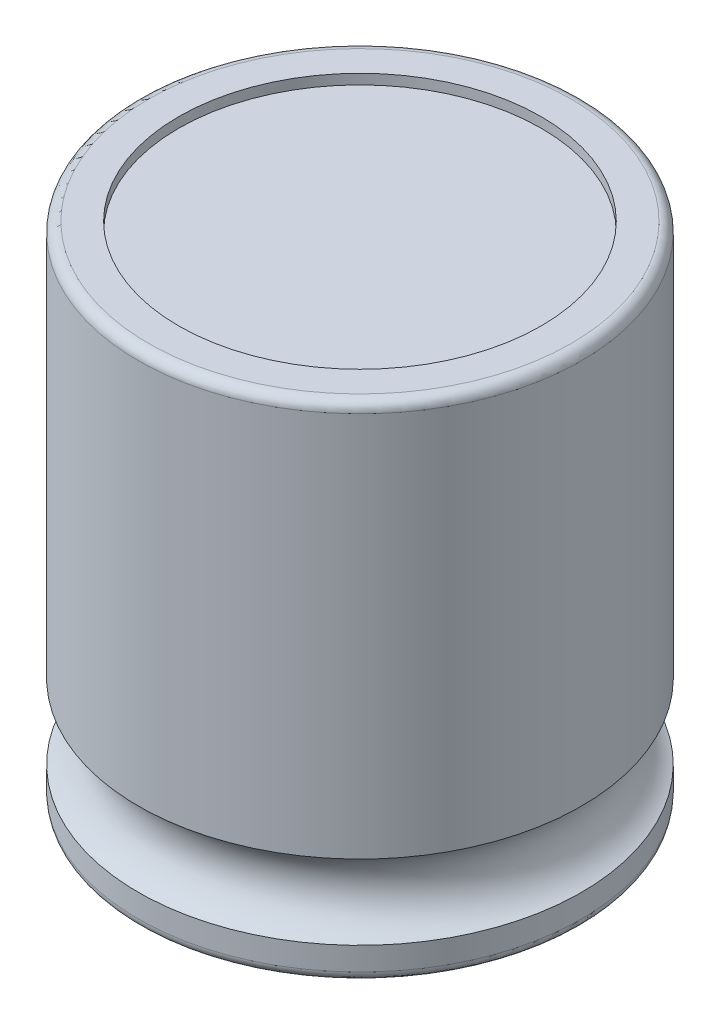
ISO-10303-21;
HEADER;
FILE_DESCRIPTION(('STEP AP214'),'2;1');
FILE_NAME('part.step','',(''),(''),'','','');
FILE_SCHEMA(('AUTOMOTIVE_DESIGN { 1 0 10303 214 1 1 1 1 }'));
ENDSEC;
DATA;
#1=APPLICATION_CONTEXT('core data for automotive mechanical design processes');
#2=APPLICATION_PROTOCOL_DEFINITION('international standard','automotive_design',2000,#1);
#3=PRODUCT_CONTEXT('',#1,'mechanical');
#4=PRODUCT('Part','Part','',(#3));
#5=PRODUCT_RELATED_PRODUCT_CATEGORY('part','',(#4));
#6=PRODUCT_DEFINITION_FORMATION('','',#4);
#7=PRODUCT_DEFINITION_CONTEXT('part definition',#1,'design');
#8=PRODUCT_DEFINITION('design','',#6,#7);
#9=PRODUCT_DEFINITION_SHAPE('','',#8);
#10=(LENGTH_UNIT() NAMED_UNIT(*) SI_UNIT(.MILLI.,.METRE.));
#11=(NAMED_UNIT(*) PLANE_ANGLE_UNIT() SI_UNIT($,.RADIAN.));
#12=(NAMED_UNIT(*) SI_UNIT($,.STERADIAN.) SOLID_ANGLE_UNIT());
#13=UNCERTAINTY_MEASURE_WITH_UNIT(LENGTH_MEASURE(1.E-05),#10,'distance_accuracy_value','');
#14=(GEOMETRIC_REPRESENTATION_CONTEXT(3) GLOBAL_UNCERTAINTY_ASSIGNED_CONTEXT((#13)) GLOBAL_UNIT_ASSIGNED_CONTEXT((#10,
#11,#12)) REPRESENTATION_CONTEXT('',''));
#15=CARTESIAN_POINT('',(0.,0.,0.));
#16=DIRECTION('',(0.,0.,1.));
#17=DIRECTION('',(1.,0.,0.));
#18=AXIS2_PLACEMENT_3D('',#15,#16,#17);
#19=CARTESIAN_POINT('',(0.,1.,0.));
#20=DIRECTION('',(0.,-1.,0.));
#21=DIRECTION('',(0.,0.,-1.));
#22=AXIS2_PLACEMENT_3D('',#19,#20,#21);
#23=PLANE('',#22);
#24=CARTESIAN_POINT('',(0.,1.,0.));
#25=DIRECTION('',(0.,-1.,0.));
#26=DIRECTION('',(0.,0.,-1.));
#27=AXIS2_PLACEMENT_3D('',#24,#25,#26);
#28=CIRCLE('',#27,9.);
#29=CARTESIAN_POINT('',(0.,1.,-9.));
#30=VERTEX_POINT('',#29);
#31=EDGE_CURVE('E280',#30,#30,#28,.T.);
#32=ORIENTED_EDGE('',*,*,#31,.T.);
#33=EDGE_LOOP('',(#32));
#34=FACE_BOUND('',#33,.T.);
#35=ADVANCED_FACE('F17',(#34),#23,.T.);
#36=CARTESIAN_POINT('',(0.,-65.12685950413,0.));
#37=DIRECTION('',(0.,-1.,0.));
#38=DIRECTION('',(0.,0.,-1.));
#39=AXIS2_PLACEMENT_3D('',#36,#37,#38);
#40=CYLINDRICAL_SURFACE('',#39,9.);
#41=ORIENTED_EDGE('',*,*,#31,.F.);
#42=EDGE_LOOP('',(#41));
#43=FACE_BOUND('',#42,.T.);
#44=CARTESIAN_POINT('',(0.,0.,0.));
#45=DIRECTION('',(0.,-1.,0.));
#46=DIRECTION('',(0.,0.,-1.));
#47=AXIS2_PLACEMENT_3D('',#44,#45,#46);
#48=CIRCLE('',#47,9.);
#49=CARTESIAN_POINT('',(0.,0.,-9.));
#50=VERTEX_POINT('',#49);
#51=EDGE_CURVE('E83',#50,#50,#48,.F.);
#52=ORIENTED_EDGE('',*,*,#51,.F.);
#53=EDGE_LOOP('',(#52));
#54=FACE_BOUND('',#53,.T.);
#55=ADVANCED_FACE('F99',(#43,#54),#40,.F.);
#56=CARTESIAN_POINT('',(9.,0.,0.));
#57=DIRECTION('',(0.,-1.,0.));
#58=DIRECTION('',(0.,0.,-1.));
#59=AXIS2_PLACEMENT_3D('',#56,#57,#58);
#60=PLANE('',#59);
#61=ORIENTED_EDGE('',*,*,#51,.T.);
#62=EDGE_LOOP('',(#61));
#63=FACE_BOUND('',#62,.T.);
#64=CARTESIAN_POINT('',(0.,0.,0.));
#65=DIRECTION('',(0.,1.,0.));
#66=DIRECTION('',(0.,0.,-1.));
#67=AXIS2_PLACEMENT_3D('',#64,#65,#66);
#68=CIRCLE('',#67,10.5);
#69=CARTESIAN_POINT('',(-10.0623058987414,0.,-3.00000000000041));
#70=VERTEX_POINT('',#69);
#71=CARTESIAN_POINT('',(0.,0.,-10.5));
#72=VERTEX_POINT('',#71);
#73=EDGE_CURVE('E72',#70,#72,#68,.F.);
#74=ORIENTED_EDGE('',*,*,#73,.T.);
#75=CARTESIAN_POINT('',(0.,0.,0.));
#76=DIRECTION('',(0.,1.,0.));
#77=DIRECTION('',(0.958314847499909,0.,-0.285714285714287));
#78=AXIS2_PLACEMENT_3D('',#75,#76,#77);
#79=CIRCLE('',#78,10.5);
#80=CARTESIAN_POINT('',(10.062305898749,0.,-3.));
#81=VERTEX_POINT('',#80);
#82=EDGE_CURVE('E66',#72,#81,#79,.F.);
#83=ORIENTED_EDGE('',*,*,#82,.T.);
#84=CARTESIAN_POINT('',(0.,0.,0.));
#85=DIRECTION('',(0.,1.,0.));
#86=DIRECTION('',(1.,0.,0.));
#87=AXIS2_PLACEMENT_3D('',#84,#85,#86);
#88=CIRCLE('',#87,10.5);
#89=CARTESIAN_POINT('',(10.5,0.,0.));
#90=VERTEX_POINT('',#89);
#91=EDGE_CURVE('E63',#90,#81,#88,.T.);
#92=ORIENTED_EDGE('',*,*,#91,.F.);
#93=CARTESIAN_POINT('',(0.,0.,0.));
#94=DIRECTION('',(0.,1.,0.));
#95=DIRECTION('',(-1.,0.,0.));
#96=AXIS2_PLACEMENT_3D('',#93,#94,#95);
#97=CIRCLE('',#96,10.5);
#98=CARTESIAN_POINT('',(-10.4999999999983,0.,0.));
#99=VERTEX_POINT('',#98);
#100=EDGE_CURVE('E120',#99,#90,#97,.T.);
#101=ORIENTED_EDGE('',*,*,#100,.F.);
#102=CARTESIAN_POINT('',(0.,0.,0.));
#103=DIRECTION('',(0.,1.,0.));
#104=DIRECTION('',(-0.95831484749984,0.,-0.285714285714522));
#105=AXIS2_PLACEMENT_3D('',#102,#103,#104);
#106=CIRCLE('',#105,10.4999999999913);
#107=EDGE_CURVE('E81',#70,#99,#106,.T.);
#108=ORIENTED_EDGE('',*,*,#107,.F.);
#109=EDGE_LOOP('',(#74,#83,#92,#101,#108));
#110=FACE_BOUND('',#109,.T.);
#111=ADVANCED_FACE('F80',(#63,#110),#60,.T.);
#112=CARTESIAN_POINT('',(0.,0.5,0.));
#113=DIRECTION('',(0.,-1.,0.));
#114=DIRECTION('',(0.,0.,-1.));
#115=AXIS2_PLACEMENT_3D('',#112,#113,#114);
#116=TOROIDAL_SURFACE('',#115,10.5,0.5);
#117=ORIENTED_EDGE('',*,*,#82,.F.);
#118=ORIENTED_EDGE('',*,*,#73,.F.);
#119=ORIENTED_EDGE('',*,*,#107,.T.);
#120=ORIENTED_EDGE('',*,*,#100,.T.);
#121=ORIENTED_EDGE('',*,*,#91,.T.);
#122=EDGE_LOOP('',(#117,#118,#119,#120,#121));
#123=FACE_BOUND('',#122,.T.);
#124=CARTESIAN_POINT('',(0.,0.5,0.));
#125=DIRECTION('',(0.,-1.,0.));
#126=DIRECTION('',(0.,0.,-1.));
#127=AXIS2_PLACEMENT_3D('',#124,#125,#126);
#128=CIRCLE('',#127,11.);
#129=CARTESIAN_POINT('',(0.,0.5,-11.));
#130=VERTEX_POINT('',#129);
#131=EDGE_CURVE('E123',#130,#130,#128,.F.);
#132=ORIENTED_EDGE('',*,*,#131,.F.);
#133=EDGE_LOOP('',(#132));
#134=FACE_BOUND('',#133,.T.);
#135=ADVANCED_FACE('F69',(#123,#134),#116,.T.);
#136=CARTESIAN_POINT('',(9.,24.5,0.));
#137=DIRECTION('',(0.,1.,0.));
#138=DIRECTION('',(0.,0.,1.));
#139=AXIS2_PLACEMENT_3D('',#136,#137,#138);
#140=PLANE('',#139);
#141=CARTESIAN_POINT('',(0.,24.5,0.));
#142=DIRECTION('',(0.,-1.,0.));
#143=DIRECTION('',(0.,0.,-1.));
#144=AXIS2_PLACEMENT_3D('',#141,#142,#143);
#145=CIRCLE('',#144,9.);
#146=CARTESIAN_POINT('',(0.,24.5,-9.));
#147=VERTEX_POINT('',#146);
#148=EDGE_CURVE('E126',#147,#147,#145,.F.);
#149=ORIENTED_EDGE('',*,*,#148,.T.);
#150=EDGE_LOOP('',(#149));
#151=FACE_BOUND('',#150,.T.);
#152=ADVANCED_FACE('F306',(#151),#140,.T.);
#153=CARTESIAN_POINT('',(0.,-65.12685950413,0.));
#154=DIRECTION('',(0.,-1.,0.));
#155=DIRECTION('',(0.,0.,-1.));
#156=AXIS2_PLACEMENT_3D('',#153,#154,#155);
#157=CYLINDRICAL_SURFACE('',#156,11.);
#158=ORIENTED_EDGE('',*,*,#131,.T.);
#159=EDGE_LOOP('',(#158));
#160=FACE_BOUND('',#159,.T.);
#161=CARTESIAN_POINT('',(0.,1.64595037822607,0.));
#162=DIRECTION('',(0.,-1.,0.));
#163=DIRECTION('',(0.,0.,-1.));
#164=AXIS2_PLACEMENT_3D('',#161,#162,#163);
#165=CIRCLE('',#164,11.);
#166=CARTESIAN_POINT('',(0.,1.64595037822607,-11.));
#167=VERTEX_POINT('',#166);
#168=EDGE_CURVE('E127',#167,#167,#165,.T.);
#169=ORIENTED_EDGE('',*,*,#168,.T.);
#170=EDGE_LOOP('',(#169));
#171=FACE_BOUND('',#170,.T.);
#172=ADVANCED_FACE('F304',(#160,#171),#157,.T.);
#173=CARTESIAN_POINT('',(0.,-65.12685950413,0.));
#174=DIRECTION('',(0.,-1.,0.));
#175=DIRECTION('',(0.,0.,-1.));
#176=AXIS2_PLACEMENT_3D('',#173,#174,#175);
#177=CYLINDRICAL_SURFACE('',#176,9.);
#178=CARTESIAN_POINT('',(0.,25.,0.));
#179=DIRECTION('',(0.,-1.,0.));
#180=DIRECTION('',(0.,0.,-1.));
#181=AXIS2_PLACEMENT_3D('',#178,#179,#180);
#182=CIRCLE('',#181,9.);
#183=CARTESIAN_POINT('',(0.,25.,-9.));
#184=VERTEX_POINT('',#183);
#185=EDGE_CURVE('E268',#184,#184,#182,.T.);
#186=ORIENTED_EDGE('',*,*,#185,.F.);
#187=EDGE_LOOP('',(#186));
#188=FACE_BOUND('',#187,.T.);
#189=ORIENTED_EDGE('',*,*,#148,.F.);
#190=EDGE_LOOP('',(#189));
#191=FACE_BOUND('',#190,.T.);
#192=ADVANCED_FACE('F177',(#188,#191),#177,.F.);
#193=CARTESIAN_POINT('',(9.,25.,0.));
#194=DIRECTION('',(0.,1.,0.));
#195=DIRECTION('',(0.,0.,1.));
#196=AXIS2_PLACEMENT_3D('',#193,#194,#195);
#197=PLANE('',#196);
#198=ORIENTED_EDGE('',*,*,#185,.T.);
#199=EDGE_LOOP('',(#198));
#200=FACE_BOUND('',#199,.T.);
#201=CARTESIAN_POINT('',(0.,25.,0.));
#202=DIRECTION('',(0.,-1.,0.));
#203=DIRECTION('',(0.958314847499909,0.,-0.285714285714287));
#204=AXIS2_PLACEMENT_3D('',#201,#202,#203);
#205=CIRCLE('',#204,10.5);
#206=CARTESIAN_POINT('',(10.062305898749,25.,-3.));
#207=VERTEX_POINT('',#206);
#208=CARTESIAN_POINT('',(10.5,25.,0.));
#209=VERTEX_POINT('',#208);
#210=EDGE_CURVE('E130',#207,#209,#205,.T.);
#211=ORIENTED_EDGE('',*,*,#210,.F.);
#212=CARTESIAN_POINT('',(0.,25.,0.));
#213=DIRECTION('',(0.,-1.,0.));
#214=DIRECTION('',(0.,0.,-1.));
#215=AXIS2_PLACEMENT_3D('',#212,#213,#214);
#216=CIRCLE('',#215,10.5);
#217=CARTESIAN_POINT('',(0.,25.,-10.4999999999974));
#218=VERTEX_POINT('',#217);
#219=EDGE_CURVE('E163',#207,#218,#216,.F.);
#220=ORIENTED_EDGE('',*,*,#219,.T.);
#221=CARTESIAN_POINT('',(0.,25.,0.));
#222=DIRECTION('',(0.,-1.,0.));
#223=DIRECTION('',(-0.95831484749984,0.,-0.285714285714522));
#224=AXIS2_PLACEMENT_3D('',#221,#222,#223);
#225=CIRCLE('',#224,10.4999999999913);
#226=CARTESIAN_POINT('',(-10.0623058987414,25.,-3.00000000000041));
#227=VERTEX_POINT('',#226);
#228=EDGE_CURVE('E225',#218,#227,#225,.F.);
#229=ORIENTED_EDGE('',*,*,#228,.T.);
#230=CARTESIAN_POINT('',(0.,25.,0.));
#231=DIRECTION('',(0.,-1.,0.));
#232=DIRECTION('',(-1.,0.,0.));
#233=AXIS2_PLACEMENT_3D('',#230,#231,#232);
#234=CIRCLE('',#233,10.5);
#235=CARTESIAN_POINT('',(-10.5,25.,0.));
#236=VERTEX_POINT('',#235);
#237=EDGE_CURVE('E37',#236,#227,#234,.T.);
#238=ORIENTED_EDGE('',*,*,#237,.F.);
#239=CARTESIAN_POINT('',(0.,25.,0.));
#240=DIRECTION('',(0.,-1.,0.));
#241=DIRECTION('',(1.,0.,0.));
#242=AXIS2_PLACEMENT_3D('',#239,#240,#241);
#243=CIRCLE('',#242,10.5);
#244=EDGE_CURVE('E159',#209,#236,#243,.T.);
#245=ORIENTED_EDGE('',*,*,#244,.F.);
#246=EDGE_LOOP('',(#211,#220,#229,#238,#245));
#247=FACE_BOUND('',#246,.T.);
#248=ADVANCED_FACE('F168',(#200,#247),#197,.T.);
#249=CARTESIAN_POINT('',(0.,3.5,0.));
#250=DIRECTION('',(0.,-1.,0.));
#251=DIRECTION('',(0.,0.,-1.));
#252=AXIS2_PLACEMENT_3D('',#249,#250,#251);
#253=TOROIDAL_SURFACE('',#252,11.75,2.);
#254=CARTESIAN_POINT('',(0.,5.35404962177399,0.));
#255=DIRECTION('',(0.,-1.,0.));
#256=DIRECTION('',(0.,0.,-1.));
#257=AXIS2_PLACEMENT_3D('',#254,#255,#256);
#258=CIRCLE('',#257,11.);
#259=CARTESIAN_POINT('',(0.,5.35404962177399,-11.));
#260=VERTEX_POINT('',#259);
#261=EDGE_CURVE('E28',#260,#260,#258,.F.);
#262=ORIENTED_EDGE('',*,*,#261,.F.);
#263=EDGE_LOOP('',(#262));
#264=FACE_BOUND('',#263,.T.);
#265=ORIENTED_EDGE('',*,*,#168,.F.);
#266=EDGE_LOOP('',(#265));
#267=FACE_BOUND('',#266,.T.);
#268=ADVANCED_FACE('F148',(#264,#267),#253,.F.);
#269=CARTESIAN_POINT('',(0.,24.5,0.));
#270=DIRECTION('',(0.,-1.,0.));
#271=DIRECTION('',(0.,0.,-1.));
#272=AXIS2_PLACEMENT_3D('',#269,#270,#271);
#273=TOROIDAL_SURFACE('',#272,10.5,0.5);
#274=CARTESIAN_POINT('',(0.,24.5,0.));
#275=DIRECTION('',(0.,-1.,0.));
#276=DIRECTION('',(0.,0.,-1.));
#277=AXIS2_PLACEMENT_3D('',#274,#275,#276);
#278=CIRCLE('',#277,11.);
#279=CARTESIAN_POINT('',(0.,24.5,-11.));
#280=VERTEX_POINT('',#279);
#281=EDGE_CURVE('E11',#280,#280,#278,.T.);
#282=ORIENTED_EDGE('',*,*,#281,.F.);
#283=EDGE_LOOP('',(#282));
#284=FACE_BOUND('',#283,.T.);
#285=ORIENTED_EDGE('',*,*,#244,.T.);
#286=ORIENTED_EDGE('',*,*,#237,.T.);
#287=ORIENTED_EDGE('',*,*,#228,.F.);
#288=ORIENTED_EDGE('',*,*,#219,.F.);
#289=ORIENTED_EDGE('',*,*,#210,.T.);
#290=EDGE_LOOP('',(#285,#286,#287,#288,#289));
#291=FACE_BOUND('',#290,.T.);
#292=ADVANCED_FACE('F136',(#284,#291),#273,.T.);
#293=CARTESIAN_POINT('',(0.,-65.12685950413,0.));
#294=DIRECTION('',(0.,-1.,0.));
#295=DIRECTION('',(0.,0.,-1.));
#296=AXIS2_PLACEMENT_3D('',#293,#294,#295);
#297=CYLINDRICAL_SURFACE('',#296,11.);
#298=ORIENTED_EDGE('',*,*,#261,.T.);
#299=EDGE_LOOP('',(#298));
#300=FACE_BOUND('',#299,.T.);
#301=ORIENTED_EDGE('',*,*,#281,.T.);
#302=EDGE_LOOP('',(#301));
#303=FACE_BOUND('',#302,.T.);
#304=ADVANCED_FACE('F147',(#300,#303),#297,.T.);
#305=CLOSED_SHELL('',(#35,#55,#111,#135,#152,#172,#192,#248,#268,#292,#304));
#306=MANIFOLD_SOLID_BREP('B1',#305);
#307=ADVANCED_BREP_SHAPE_REPRESENTATION('',(#18,#306),#14);
#308=SHAPE_DEFINITION_REPRESENTATION(#9,#307);
ENDSEC;
END-ISO-10303-21;
